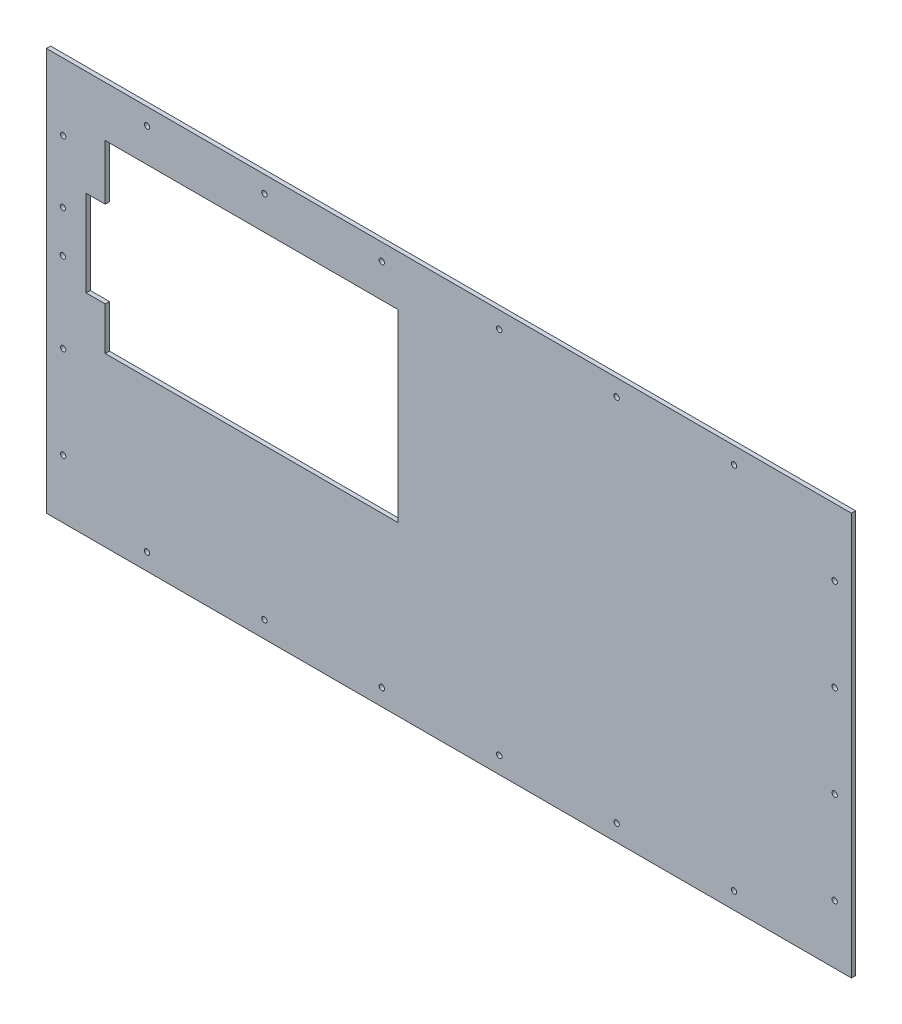
ISO-10303-21;
HEADER;
FILE_DESCRIPTION(('STEP AP214'),'2;1');
FILE_NAME('part.step','',(''),(''),'','','');
FILE_SCHEMA(('AUTOMOTIVE_DESIGN { 1 0 10303 214 1 1 1 1 }'));
ENDSEC;
DATA;
#1=APPLICATION_CONTEXT('core data for automotive mechanical design processes');
#2=APPLICATION_PROTOCOL_DEFINITION('international standard','automotive_design',2000,#1);
#3=PRODUCT_CONTEXT('',#1,'mechanical');
#4=PRODUCT('Part','Part','',(#3));
#5=PRODUCT_RELATED_PRODUCT_CATEGORY('part','',(#4));
#6=PRODUCT_DEFINITION_FORMATION('','',#4);
#7=PRODUCT_DEFINITION_CONTEXT('part definition',#1,'design');
#8=PRODUCT_DEFINITION('design','',#6,#7);
#9=PRODUCT_DEFINITION_SHAPE('','',#8);
#10=(LENGTH_UNIT() NAMED_UNIT(*) SI_UNIT(.MILLI.,.METRE.));
#11=(NAMED_UNIT(*) PLANE_ANGLE_UNIT() SI_UNIT($,.RADIAN.));
#12=(NAMED_UNIT(*) SI_UNIT($,.STERADIAN.) SOLID_ANGLE_UNIT());
#13=UNCERTAINTY_MEASURE_WITH_UNIT(LENGTH_MEASURE(1.E-05),#10,'distance_accuracy_value','');
#14=(GEOMETRIC_REPRESENTATION_CONTEXT(3) GLOBAL_UNCERTAINTY_ASSIGNED_CONTEXT((#13)) GLOBAL_UNIT_ASSIGNED_CONTEXT((#10,
#11,#12)) REPRESENTATION_CONTEXT('',''));
#15=CARTESIAN_POINT('',(0.,0.,0.));
#16=DIRECTION('',(0.,0.,1.));
#17=DIRECTION('',(1.,0.,0.));
#18=AXIS2_PLACEMENT_3D('',#15,#16,#17);
#19=CARTESIAN_POINT('',(-565.03357937027,266.7,0.));
#20=DIRECTION('',(-1.,0.,0.));
#21=DIRECTION('',(0.,0.,1.));
#22=AXIS2_PLACEMENT_3D('',#19,#20,#21);
#23=PLANE('',#22);
#24=DIRECTION('',(0.,-1.,0.));
#25=VECTOR('',#24,1.);
#26=CARTESIAN_POINT('',(-565.03357937027,266.7,3.175));
#27=LINE('',#26,#25);
#28=CARTESIAN_POINT('',(-565.03357937027,266.7,3.175));
#29=VERTEX_POINT('',#28);
#30=CARTESIAN_POINT('',(-565.03357937027,224.893339008683,3.175));
#31=VERTEX_POINT('',#30);
#32=EDGE_CURVE('E173',#29,#31,#27,.T.);
#33=ORIENTED_EDGE('',*,*,#32,.T.);
#34=DIRECTION('',(0.,0.,-1.));
#35=VECTOR('',#34,1.);
#36=CARTESIAN_POINT('',(-565.03357937027,224.893339008683,3.175));
#37=LINE('',#36,#35);
#38=CARTESIAN_POINT('',(-565.03357937027,224.893339008683,0.));
#39=VERTEX_POINT('',#38);
#40=EDGE_CURVE('E154',#31,#39,#37,.T.);
#41=ORIENTED_EDGE('',*,*,#40,.T.);
#42=DIRECTION('',(0.,-1.,0.));
#43=VECTOR('',#42,1.);
#44=CARTESIAN_POINT('',(-565.03357937027,266.7,0.));
#45=LINE('',#44,#43);
#46=CARTESIAN_POINT('',(-565.03357937027,266.7,0.));
#47=VERTEX_POINT('',#46);
#48=EDGE_CURVE('E159',#47,#39,#45,.T.);
#49=ORIENTED_EDGE('',*,*,#48,.F.);
#50=DIRECTION('',(0.,0.,1.));
#51=VECTOR('',#50,1.);
#52=CARTESIAN_POINT('',(-565.03357937027,266.7,0.));
#53=LINE('',#52,#51);
#54=EDGE_CURVE('E185',#47,#29,#53,.T.);
#55=ORIENTED_EDGE('',*,*,#54,.T.);
#56=EDGE_LOOP('',(#33,#41,#49,#55));
#57=FACE_BOUND('',#56,.T.);
#58=ADVANCED_FACE('F36',(#57),#23,.F.);
#59=CARTESIAN_POINT('',(0.,0.,3.175));
#60=DIRECTION('',(0.,0.,1.));
#61=DIRECTION('',(1.,0.,0.));
#62=AXIS2_PLACEMENT_3D('',#59,#60,#61);
#63=PLANE('',#62);
#64=DIRECTION('',(1.,0.,0.));
#65=VECTOR('',#64,1.);
#66=CARTESIAN_POINT('',(-565.03357937027,224.893339008683,3.175));
#67=LINE('',#66,#65);
#68=CARTESIAN_POINT('',(-579.523282634334,224.893339008683,3.175));
#69=VERTEX_POINT('',#68);
#70=EDGE_CURVE('E141',#69,#31,#67,.T.);
#71=ORIENTED_EDGE('',*,*,#70,.T.);
#72=ORIENTED_EDGE('',*,*,#32,.F.);
#73=DIRECTION('',(-1.,0.,0.));
#74=VECTOR('',#73,1.);
#75=CARTESIAN_POINT('',(-565.03357937027,266.7,3.175));
#76=LINE('',#75,#74);
#77=CARTESIAN_POINT('',(-343.33357928627,266.7,3.175));
#78=VERTEX_POINT('',#77);
#79=EDGE_CURVE('E182',#78,#29,#76,.T.);
#80=ORIENTED_EDGE('',*,*,#79,.F.);
#81=DIRECTION('',(0.,1.,0.));
#82=VECTOR('',#81,1.);
#83=CARTESIAN_POINT('',(-343.33357928627,266.7,3.175));
#84=LINE('',#83,#82);
#85=CARTESIAN_POINT('',(-343.33357928627,127.,3.175));
#86=VERTEX_POINT('',#85);
#87=EDGE_CURVE('E179',#86,#78,#84,.T.);
#88=ORIENTED_EDGE('',*,*,#87,.F.);
#89=DIRECTION('',(1.,0.,0.));
#90=VECTOR('',#89,1.);
#91=CARTESIAN_POINT('',(-565.03357937027,127.,3.175));
#92=LINE('',#91,#90);
#93=CARTESIAN_POINT('',(-565.03357937027,127.,3.175));
#94=VERTEX_POINT('',#93);
#95=EDGE_CURVE('E176',#94,#86,#92,.T.);
#96=ORIENTED_EDGE('',*,*,#95,.F.);
#97=CARTESIAN_POINT('',(-565.03357937027,159.519325593124,3.175));
#98=VERTEX_POINT('',#97);
#99=EDGE_CURVE('E58',#98,#94,#27,.T.);
#100=ORIENTED_EDGE('',*,*,#99,.F.);
#101=DIRECTION('',(-1.,0.,0.));
#102=VECTOR('',#101,1.);
#103=CARTESIAN_POINT('',(-565.03357937027,159.519325593124,3.175));
#104=LINE('',#103,#102);
#105=CARTESIAN_POINT('',(-579.523282634334,159.519325593124,3.175));
#106=VERTEX_POINT('',#105);
#107=EDGE_CURVE('E51',#98,#106,#104,.T.);
#108=ORIENTED_EDGE('',*,*,#107,.T.);
#109=DIRECTION('',(0.,1.,0.));
#110=VECTOR('',#109,1.);
#111=CARTESIAN_POINT('',(-579.523282634334,159.519325593124,3.175));
#112=LINE('',#111,#110);
#113=EDGE_CURVE('E136',#106,#69,#112,.T.);
#114=ORIENTED_EDGE('',*,*,#113,.T.);
#115=EDGE_LOOP('',(#71,#72,#80,#88,#96,#100,#108,#114));
#116=FACE_BOUND('',#115,.T.);
#117=CARTESIAN_POINT('',(-597.110646496567,175.018670591768,3.175));
#118=DIRECTION('',(0.,0.,1.));
#119=DIRECTION('',(1.,0.,0.));
#120=AXIS2_PLACEMENT_3D('',#117,#118,#119);
#121=CIRCLE('',#120,2.03200000000001);
#122=CARTESIAN_POINT('',(-595.078646496567,175.018670591768,3.175));
#123=VERTEX_POINT('',#122);
#124=EDGE_CURVE('E197',#123,#123,#121,.T.);
#125=ORIENTED_EDGE('',*,*,#124,.F.);
#126=EDGE_LOOP('',(#125));
#127=FACE_BOUND('',#126,.T.);
#128=CARTESIAN_POINT('',(-597.110646496567,206.768670591768,3.175));
#129=DIRECTION('',(0.,0.,1.));
#130=DIRECTION('',(1.,0.,0.));
#131=AXIS2_PLACEMENT_3D('',#128,#129,#130);
#132=CIRCLE('',#131,2.03200000000001);
#133=CARTESIAN_POINT('',(-595.078646496567,206.768670591768,3.175));
#134=VERTEX_POINT('',#133);
#135=EDGE_CURVE('E187',#134,#134,#132,.T.);
#136=ORIENTED_EDGE('',*,*,#135,.F.);
#137=EDGE_LOOP('',(#136));
#138=FACE_BOUND('',#137,.T.);
#139=CARTESIAN_POINT('',(-596.899999999998,114.3,3.175));
#140=DIRECTION('',(0.,0.,1.));
#141=DIRECTION('',(1.,0.,0.));
#142=AXIS2_PLACEMENT_3D('',#139,#140,#141);
#143=CIRCLE('',#142,2.03200000000001);
#144=CARTESIAN_POINT('',(-594.867999999998,114.3,3.175));
#145=VERTEX_POINT('',#144);
#146=EDGE_CURVE('E243',#145,#145,#143,.F.);
#147=ORIENTED_EDGE('',*,*,#146,.T.);
#148=EDGE_LOOP('',(#147));
#149=FACE_BOUND('',#148,.T.);
#150=CARTESIAN_POINT('',(-596.899999999998,44.45,3.175));
#151=DIRECTION('',(0.,0.,1.));
#152=DIRECTION('',(1.,0.,0.));
#153=AXIS2_PLACEMENT_3D('',#150,#151,#152);
#154=CIRCLE('',#153,2.03200000000001);
#155=CARTESIAN_POINT('',(-594.867999999998,44.45,3.175));
#156=VERTEX_POINT('',#155);
#157=EDGE_CURVE('E240',#156,#156,#154,.F.);
#158=ORIENTED_EDGE('',*,*,#157,.T.);
#159=EDGE_LOOP('',(#158));
#160=FACE_BOUND('',#159,.T.);
#161=CARTESIAN_POINT('',(-596.9,254.,3.175));
#162=DIRECTION('',(0.,0.,1.));
#163=DIRECTION('',(1.,0.,0.));
#164=AXIS2_PLACEMENT_3D('',#161,#162,#163);
#165=CIRCLE('',#164,2.03200000000001);
#166=CARTESIAN_POINT('',(-594.868,254.,3.175));
#167=VERTEX_POINT('',#166);
#168=EDGE_CURVE('E225',#167,#167,#165,.F.);
#169=ORIENTED_EDGE('',*,*,#168,.T.);
#170=EDGE_LOOP('',(#169));
#171=FACE_BOUND('',#170,.T.);
#172=CARTESIAN_POINT('',(-266.7,292.1,3.175));
#173=DIRECTION('',(0.,0.,1.));
#174=DIRECTION('',(-1.,0.,0.));
#175=AXIS2_PLACEMENT_3D('',#172,#173,#174);
#176=CIRCLE('',#175,2.03200000000001);
#177=CARTESIAN_POINT('',(-268.732,292.1,3.175));
#178=VERTEX_POINT('',#177);
#179=EDGE_CURVE('E250',#178,#178,#176,.T.);
#180=ORIENTED_EDGE('',*,*,#179,.F.);
#181=EDGE_LOOP('',(#180));
#182=FACE_BOUND('',#181,.T.);
#183=CARTESIAN_POINT('',(-177.8,292.1,3.175));
#184=DIRECTION('',(0.,0.,1.));
#185=DIRECTION('',(-1.,0.,0.));
#186=AXIS2_PLACEMENT_3D('',#183,#184,#185);
#187=CIRCLE('',#186,2.032);
#188=CARTESIAN_POINT('',(-179.832,292.1,3.175));
#189=VERTEX_POINT('',#188);
#190=EDGE_CURVE('E281',#189,#189,#187,.T.);
#191=ORIENTED_EDGE('',*,*,#190,.F.);
#192=EDGE_LOOP('',(#191));
#193=FACE_BOUND('',#192,.T.);
#194=CARTESIAN_POINT('',(-88.9000000000005,292.1,3.175));
#195=DIRECTION('',(0.,0.,1.));
#196=DIRECTION('',(-1.,0.,0.));
#197=AXIS2_PLACEMENT_3D('',#194,#195,#196);
#198=CIRCLE('',#197,2.032);
#199=CARTESIAN_POINT('',(-90.9320000000005,292.1,3.175));
#200=VERTEX_POINT('',#199);
#201=EDGE_CURVE('E275',#200,#200,#198,.T.);
#202=ORIENTED_EDGE('',*,*,#201,.F.);
#203=EDGE_LOOP('',(#202));
#204=FACE_BOUND('',#203,.T.);
#205=CARTESIAN_POINT('',(-88.9000000000001,12.7,3.175));
#206=DIRECTION('',(0.,0.,1.));
#207=DIRECTION('',(1.,0.,0.));
#208=AXIS2_PLACEMENT_3D('',#205,#206,#207);
#209=CIRCLE('',#208,2.03200000000001);
#210=CARTESIAN_POINT('',(-86.8680000000001,12.7,3.175));
#211=VERTEX_POINT('',#210);
#212=EDGE_CURVE('E269',#211,#211,#209,.T.);
#213=ORIENTED_EDGE('',*,*,#212,.F.);
#214=EDGE_LOOP('',(#213));
#215=FACE_BOUND('',#214,.T.);
#216=CARTESIAN_POINT('',(-177.8,12.7,3.175));
#217=DIRECTION('',(0.,0.,1.));
#218=DIRECTION('',(1.,0.,0.));
#219=AXIS2_PLACEMENT_3D('',#216,#217,#218);
#220=CIRCLE('',#219,2.03200000000001);
#221=CARTESIAN_POINT('',(-175.768,12.7,3.175));
#222=VERTEX_POINT('',#221);
#223=EDGE_CURVE('E268',#222,#222,#220,.T.);
#224=ORIENTED_EDGE('',*,*,#223,.F.);
#225=EDGE_LOOP('',(#224));
#226=FACE_BOUND('',#225,.T.);
#227=CARTESIAN_POINT('',(-266.7,12.7,3.175));
#228=DIRECTION('',(0.,0.,1.));
#229=DIRECTION('',(1.,0.,0.));
#230=AXIS2_PLACEMENT_3D('',#227,#228,#229);
#231=CIRCLE('',#230,2.03200000000001);
#232=CARTESIAN_POINT('',(-264.668,12.7,3.175));
#233=VERTEX_POINT('',#232);
#234=EDGE_CURVE('E305',#233,#233,#231,.T.);
#235=ORIENTED_EDGE('',*,*,#234,.F.);
#236=EDGE_LOOP('',(#235));
#237=FACE_BOUND('',#236,.T.);
#238=CARTESIAN_POINT('',(-355.6,12.7,3.175));
#239=DIRECTION('',(0.,0.,1.));
#240=DIRECTION('',(1.,0.,0.));
#241=AXIS2_PLACEMENT_3D('',#238,#239,#240);
#242=CIRCLE('',#241,2.03200000000001);
#243=CARTESIAN_POINT('',(-353.568,12.7,3.175));
#244=VERTEX_POINT('',#243);
#245=EDGE_CURVE('E299',#244,#244,#242,.T.);
#246=ORIENTED_EDGE('',*,*,#245,.F.);
#247=EDGE_LOOP('',(#246));
#248=FACE_BOUND('',#247,.T.);
#249=CARTESIAN_POINT('',(-444.5,12.7,3.175));
#250=DIRECTION('',(0.,0.,1.));
#251=DIRECTION('',(1.,0.,0.));
#252=AXIS2_PLACEMENT_3D('',#249,#250,#251);
#253=CIRCLE('',#252,2.03200000000001);
#254=CARTESIAN_POINT('',(-442.468,12.7,3.175));
#255=VERTEX_POINT('',#254);
#256=EDGE_CURVE('E293',#255,#255,#253,.T.);
#257=ORIENTED_EDGE('',*,*,#256,.F.);
#258=EDGE_LOOP('',(#257));
#259=FACE_BOUND('',#258,.T.);
#260=CARTESIAN_POINT('',(-355.6,292.1,3.175));
#261=DIRECTION('',(0.,0.,1.));
#262=DIRECTION('',(-1.,0.,0.));
#263=AXIS2_PLACEMENT_3D('',#260,#261,#262);
#264=CIRCLE('',#263,2.03200000000001);
#265=CARTESIAN_POINT('',(-357.632,292.1,3.175));
#266=VERTEX_POINT('',#265);
#267=EDGE_CURVE('E251',#266,#266,#264,.T.);
#268=ORIENTED_EDGE('',*,*,#267,.F.);
#269=EDGE_LOOP('',(#268));
#270=FACE_BOUND('',#269,.T.);
#271=CARTESIAN_POINT('',(-444.5,292.1,3.175));
#272=DIRECTION('',(0.,0.,1.));
#273=DIRECTION('',(-1.,0.,0.));
#274=AXIS2_PLACEMENT_3D('',#271,#272,#273);
#275=CIRCLE('',#274,2.03200000000001);
#276=CARTESIAN_POINT('',(-446.532,292.1,3.175));
#277=VERTEX_POINT('',#276);
#278=EDGE_CURVE('E257',#277,#277,#275,.T.);
#279=ORIENTED_EDGE('',*,*,#278,.F.);
#280=EDGE_LOOP('',(#279));
#281=FACE_BOUND('',#280,.T.);
#282=CARTESIAN_POINT('',(-533.4,292.1,3.175));
#283=DIRECTION('',(0.,0.,1.));
#284=DIRECTION('',(-1.,0.,0.));
#285=AXIS2_PLACEMENT_3D('',#282,#283,#284);
#286=CIRCLE('',#285,2.03200000000001);
#287=CARTESIAN_POINT('',(-535.432,292.1,3.175));
#288=VERTEX_POINT('',#287);
#289=EDGE_CURVE('E246',#288,#288,#286,.T.);
#290=ORIENTED_EDGE('',*,*,#289,.F.);
#291=EDGE_LOOP('',(#290));
#292=FACE_BOUND('',#291,.T.);
#293=CARTESIAN_POINT('',(-533.4,12.7,3.175));
#294=DIRECTION('',(0.,0.,1.));
#295=DIRECTION('',(1.,0.,0.));
#296=AXIS2_PLACEMENT_3D('',#293,#294,#295);
#297=CIRCLE('',#296,2.03200000000001);
#298=CARTESIAN_POINT('',(-531.368,12.7,3.175));
#299=VERTEX_POINT('',#298);
#300=EDGE_CURVE('E292',#299,#299,#297,.T.);
#301=ORIENTED_EDGE('',*,*,#300,.F.);
#302=EDGE_LOOP('',(#301));
#303=FACE_BOUND('',#302,.T.);
#304=DIRECTION('',(0.,1.,0.));
#305=VECTOR('',#304,1.);
#306=CARTESIAN_POINT('',(0.,0.,3.175));
#307=LINE('',#306,#305);
#308=CARTESIAN_POINT('',(0.,0.,3.175));
#309=VERTEX_POINT('',#308);
#310=CARTESIAN_POINT('',(0.,304.8,3.175));
#311=VERTEX_POINT('',#310);
#312=EDGE_CURVE('E319',#309,#311,#307,.T.);
#313=ORIENTED_EDGE('',*,*,#312,.T.);
#314=DIRECTION('',(-1.,0.,0.));
#315=VECTOR('',#314,1.);
#316=CARTESIAN_POINT('',(0.,304.8,3.175));
#317=LINE('',#316,#315);
#318=CARTESIAN_POINT('',(-609.6,304.8,3.175));
#319=VERTEX_POINT('',#318);
#320=EDGE_CURVE('E322',#311,#319,#317,.T.);
#321=ORIENTED_EDGE('',*,*,#320,.T.);
#322=DIRECTION('',(0.,-1.,0.));
#323=VECTOR('',#322,1.);
#324=CARTESIAN_POINT('',(-609.6,0.,3.175));
#325=LINE('',#324,#323);
#326=CARTESIAN_POINT('',(-609.6,0.,3.175));
#327=VERTEX_POINT('',#326);
#328=EDGE_CURVE('E325',#319,#327,#325,.T.);
#329=ORIENTED_EDGE('',*,*,#328,.T.);
#330=DIRECTION('',(1.,0.,0.));
#331=VECTOR('',#330,1.);
#332=CARTESIAN_POINT('',(0.,0.,3.175));
#333=LINE('',#332,#331);
#334=EDGE_CURVE('E327',#327,#309,#333,.T.);
#335=ORIENTED_EDGE('',*,*,#334,.T.);
#336=EDGE_LOOP('',(#313,#321,#329,#335));
#337=FACE_BOUND('',#336,.T.);
#338=CARTESIAN_POINT('',(-12.7000000000024,44.4499999999998,3.175));
#339=DIRECTION('',(0.,0.,1.));
#340=DIRECTION('',(1.,0.,0.));
#341=AXIS2_PLACEMENT_3D('',#338,#339,#340);
#342=CIRCLE('',#341,2.03200000000001);
#343=CARTESIAN_POINT('',(-10.6680000000024,44.4499999999998,3.175));
#344=VERTEX_POINT('',#343);
#345=EDGE_CURVE('E228',#344,#344,#342,.T.);
#346=ORIENTED_EDGE('',*,*,#345,.F.);
#347=EDGE_LOOP('',(#346));
#348=FACE_BOUND('',#347,.T.);
#349=CARTESIAN_POINT('',(-12.7000000000016,114.3,3.175));
#350=DIRECTION('',(0.,0.,1.));
#351=DIRECTION('',(1.,0.,0.));
#352=AXIS2_PLACEMENT_3D('',#349,#350,#351);
#353=CIRCLE('',#352,2.03199999999991);
#354=CARTESIAN_POINT('',(-10.6680000000017,114.3,3.175));
#355=VERTEX_POINT('',#354);
#356=EDGE_CURVE('E231',#355,#355,#353,.T.);
#357=ORIENTED_EDGE('',*,*,#356,.F.);
#358=EDGE_LOOP('',(#357));
#359=FACE_BOUND('',#358,.T.);
#360=CARTESIAN_POINT('',(-12.7000000000008,184.15,3.175));
#361=DIRECTION('',(0.,0.,1.));
#362=DIRECTION('',(1.,0.,0.));
#363=AXIS2_PLACEMENT_3D('',#360,#361,#362);
#364=CIRCLE('',#363,2.03200000000001);
#365=CARTESIAN_POINT('',(-10.6680000000008,184.15,3.175));
#366=VERTEX_POINT('',#365);
#367=EDGE_CURVE('E234',#366,#366,#364,.T.);
#368=ORIENTED_EDGE('',*,*,#367,.F.);
#369=EDGE_LOOP('',(#368));
#370=FACE_BOUND('',#369,.T.);
#371=CARTESIAN_POINT('',(-12.6999999999999,254.,3.175));
#372=DIRECTION('',(0.,0.,1.));
#373=DIRECTION('',(1.,0.,0.));
#374=AXIS2_PLACEMENT_3D('',#371,#372,#373);
#375=CIRCLE('',#374,2.03200000000001);
#376=CARTESIAN_POINT('',(-10.6679999999999,254.,3.175));
#377=VERTEX_POINT('',#376);
#378=EDGE_CURVE('E237',#377,#377,#375,.T.);
#379=ORIENTED_EDGE('',*,*,#378,.F.);
#380=EDGE_LOOP('',(#379));
#381=FACE_BOUND('',#380,.T.);
#382=ADVANCED_FACE('F143',(#116,#127,#138,#149,#160,#171,#182,#193,#204,#215,#226,#237,#248,
#259,#270,#281,#292,#303,#337,#348,#359,#370,#381),#63,.T.);
#383=CARTESIAN_POINT('',(0.,0.,0.));
#384=DIRECTION('',(0.,0.,1.));
#385=DIRECTION('',(1.,0.,0.));
#386=AXIS2_PLACEMENT_3D('',#383,#384,#385);
#387=PLANE('',#386);
#388=ORIENTED_EDGE('',*,*,#48,.T.);
#389=DIRECTION('',(1.,0.,0.));
#390=VECTOR('',#389,1.);
#391=CARTESIAN_POINT('',(-565.03357937027,224.893339008683,0.));
#392=LINE('',#391,#390);
#393=CARTESIAN_POINT('',(-579.523282634334,224.893339008683,0.));
#394=VERTEX_POINT('',#393);
#395=EDGE_CURVE('E146',#394,#39,#392,.T.);
#396=ORIENTED_EDGE('',*,*,#395,.F.);
#397=DIRECTION('',(0.,1.,0.));
#398=VECTOR('',#397,1.);
#399=CARTESIAN_POINT('',(-579.523282634334,159.519325593124,0.));
#400=LINE('',#399,#398);
#401=CARTESIAN_POINT('',(-579.523282634334,159.519325593124,0.));
#402=VERTEX_POINT('',#401);
#403=EDGE_CURVE('E148',#402,#394,#400,.T.);
#404=ORIENTED_EDGE('',*,*,#403,.F.);
#405=DIRECTION('',(-1.,0.,0.));
#406=VECTOR('',#405,1.);
#407=CARTESIAN_POINT('',(-565.03357937027,159.519325593124,0.));
#408=LINE('',#407,#406);
#409=CARTESIAN_POINT('',(-565.03357937027,159.519325593124,0.));
#410=VERTEX_POINT('',#409);
#411=EDGE_CURVE('E128',#410,#402,#408,.T.);
#412=ORIENTED_EDGE('',*,*,#411,.F.);
#413=CARTESIAN_POINT('',(-565.03357937027,127.,0.));
#414=VERTEX_POINT('',#413);
#415=EDGE_CURVE('E163',#410,#414,#45,.T.);
#416=ORIENTED_EDGE('',*,*,#415,.T.);
#417=DIRECTION('',(1.,0.,0.));
#418=VECTOR('',#417,1.);
#419=CARTESIAN_POINT('',(-565.03357937027,127.,0.));
#420=LINE('',#419,#418);
#421=CARTESIAN_POINT('',(-343.33357928627,127.,0.));
#422=VERTEX_POINT('',#421);
#423=EDGE_CURVE('E162',#414,#422,#420,.T.);
#424=ORIENTED_EDGE('',*,*,#423,.T.);
#425=DIRECTION('',(0.,1.,0.));
#426=VECTOR('',#425,1.);
#427=CARTESIAN_POINT('',(-343.33357928627,266.7,0.));
#428=LINE('',#427,#426);
#429=CARTESIAN_POINT('',(-343.33357928627,266.7,0.));
#430=VERTEX_POINT('',#429);
#431=EDGE_CURVE('E166',#422,#430,#428,.T.);
#432=ORIENTED_EDGE('',*,*,#431,.T.);
#433=DIRECTION('',(-1.,0.,0.));
#434=VECTOR('',#433,1.);
#435=CARTESIAN_POINT('',(-565.03357937027,266.7,0.));
#436=LINE('',#435,#434);
#437=EDGE_CURVE('E169',#430,#47,#436,.T.);
#438=ORIENTED_EDGE('',*,*,#437,.T.);
#439=EDGE_LOOP('',(#388,#396,#404,#412,#416,#424,#432,#438));
#440=FACE_BOUND('',#439,.T.);
#441=CARTESIAN_POINT('',(-597.110646496567,175.018670591768,0.));
#442=DIRECTION('',(0.,0.,1.));
#443=DIRECTION('',(1.,0.,0.));
#444=AXIS2_PLACEMENT_3D('',#441,#442,#443);
#445=CIRCLE('',#444,2.03200000000001);
#446=CARTESIAN_POINT('',(-595.078646496567,175.018670591768,0.));
#447=VERTEX_POINT('',#446);
#448=EDGE_CURVE('E193',#447,#447,#445,.T.);
#449=ORIENTED_EDGE('',*,*,#448,.T.);
#450=EDGE_LOOP('',(#449));
#451=FACE_BOUND('',#450,.T.);
#452=CARTESIAN_POINT('',(-597.110646496567,206.768670591768,0.));
#453=DIRECTION('',(0.,0.,1.));
#454=DIRECTION('',(1.,0.,0.));
#455=AXIS2_PLACEMENT_3D('',#452,#453,#454);
#456=CIRCLE('',#455,2.03200000000001);
#457=CARTESIAN_POINT('',(-595.078646496567,206.768670591768,0.));
#458=VERTEX_POINT('',#457);
#459=EDGE_CURVE('E200',#458,#458,#456,.T.);
#460=ORIENTED_EDGE('',*,*,#459,.T.);
#461=EDGE_LOOP('',(#460));
#462=FACE_BOUND('',#461,.T.);
#463=CARTESIAN_POINT('',(-596.899999999998,114.3,0.));
#464=DIRECTION('',(0.,0.,1.));
#465=DIRECTION('',(1.,0.,0.));
#466=AXIS2_PLACEMENT_3D('',#463,#464,#465);
#467=CIRCLE('',#466,2.03200000000001);
#468=CARTESIAN_POINT('',(-594.867999999998,114.3,0.));
#469=VERTEX_POINT('',#468);
#470=EDGE_CURVE('E211',#469,#469,#467,.T.);
#471=ORIENTED_EDGE('',*,*,#470,.T.);
#472=EDGE_LOOP('',(#471));
#473=FACE_BOUND('',#472,.T.);
#474=CARTESIAN_POINT('',(-596.899999999998,44.45,0.));
#475=DIRECTION('',(0.,0.,1.));
#476=DIRECTION('',(1.,0.,0.));
#477=AXIS2_PLACEMENT_3D('',#474,#475,#476);
#478=CIRCLE('',#477,2.03200000000001);
#479=CARTESIAN_POINT('',(-594.867999999998,44.45,0.));
#480=VERTEX_POINT('',#479);
#481=EDGE_CURVE('E215',#480,#480,#478,.T.);
#482=ORIENTED_EDGE('',*,*,#481,.T.);
#483=EDGE_LOOP('',(#482));
#484=FACE_BOUND('',#483,.T.);
#485=CARTESIAN_POINT('',(-12.7000000000008,184.15,0.));
#486=DIRECTION('',(0.,0.,-1.));
#487=DIRECTION('',(-1.,0.,0.));
#488=AXIS2_PLACEMENT_3D('',#485,#486,#487);
#489=CIRCLE('',#488,2.03200000000001);
#490=CARTESIAN_POINT('',(-14.7320000000008,184.15,0.));
#491=VERTEX_POINT('',#490);
#492=EDGE_CURVE('E208',#491,#491,#489,.T.);
#493=ORIENTED_EDGE('',*,*,#492,.F.);
#494=EDGE_LOOP('',(#493));
#495=FACE_BOUND('',#494,.T.);
#496=CARTESIAN_POINT('',(-12.7000000000024,44.4499999999998,0.));
#497=DIRECTION('',(0.,0.,-1.));
#498=DIRECTION('',(-1.,0.,0.));
#499=AXIS2_PLACEMENT_3D('',#496,#497,#498);
#500=CIRCLE('',#499,2.03200000000001);
#501=CARTESIAN_POINT('',(-14.7320000000024,44.4499999999998,0.));
#502=VERTEX_POINT('',#501);
#503=EDGE_CURVE('E196',#502,#502,#500,.T.);
#504=ORIENTED_EDGE('',*,*,#503,.F.);
#505=EDGE_LOOP('',(#504));
#506=FACE_BOUND('',#505,.T.);
#507=CARTESIAN_POINT('',(-596.9,254.,0.));
#508=DIRECTION('',(0.,0.,1.));
#509=DIRECTION('',(1.,0.,0.));
#510=AXIS2_PLACEMENT_3D('',#507,#508,#509);
#511=CIRCLE('',#510,2.03200000000001);
#512=CARTESIAN_POINT('',(-594.868,254.,0.));
#513=VERTEX_POINT('',#512);
#514=EDGE_CURVE('E214',#513,#513,#511,.T.);
#515=ORIENTED_EDGE('',*,*,#514,.T.);
#516=EDGE_LOOP('',(#515));
#517=FACE_BOUND('',#516,.T.);
#518=CARTESIAN_POINT('',(-266.7,292.1,0.));
#519=DIRECTION('',(0.,0.,1.));
#520=DIRECTION('',(-1.,0.,0.));
#521=AXIS2_PLACEMENT_3D('',#518,#519,#520);
#522=CIRCLE('',#521,2.03200000000001);
#523=CARTESIAN_POINT('',(-268.732,292.1,0.));
#524=VERTEX_POINT('',#523);
#525=EDGE_CURVE('E284',#524,#524,#522,.T.);
#526=ORIENTED_EDGE('',*,*,#525,.T.);
#527=EDGE_LOOP('',(#526));
#528=FACE_BOUND('',#527,.T.);
#529=CARTESIAN_POINT('',(-177.8,292.1,0.));
#530=DIRECTION('',(0.,0.,1.));
#531=DIRECTION('',(-1.,0.,0.));
#532=AXIS2_PLACEMENT_3D('',#529,#530,#531);
#533=CIRCLE('',#532,2.032);
#534=CARTESIAN_POINT('',(-179.832,292.1,0.));
#535=VERTEX_POINT('',#534);
#536=EDGE_CURVE('E278',#535,#535,#533,.T.);
#537=ORIENTED_EDGE('',*,*,#536,.T.);
#538=EDGE_LOOP('',(#537));
#539=FACE_BOUND('',#538,.T.);
#540=CARTESIAN_POINT('',(-88.9000000000005,292.1,0.));
#541=DIRECTION('',(0.,0.,1.));
#542=DIRECTION('',(-1.,0.,0.));
#543=AXIS2_PLACEMENT_3D('',#540,#541,#542);
#544=CIRCLE('',#543,2.032);
#545=CARTESIAN_POINT('',(-90.9320000000005,292.1,0.));
#546=VERTEX_POINT('',#545);
#547=EDGE_CURVE('E272',#546,#546,#544,.T.);
#548=ORIENTED_EDGE('',*,*,#547,.T.);
#549=EDGE_LOOP('',(#548));
#550=FACE_BOUND('',#549,.T.);
#551=CARTESIAN_POINT('',(-88.9000000000001,12.7,0.));
#552=DIRECTION('',(0.,0.,1.));
#553=DIRECTION('',(1.,0.,0.));
#554=AXIS2_PLACEMENT_3D('',#551,#552,#553);
#555=CIRCLE('',#554,2.03200000000001);
#556=CARTESIAN_POINT('',(-86.8680000000001,12.7,0.));
#557=VERTEX_POINT('',#556);
#558=EDGE_CURVE('E265',#557,#557,#555,.T.);
#559=ORIENTED_EDGE('',*,*,#558,.T.);
#560=EDGE_LOOP('',(#559));
#561=FACE_BOUND('',#560,.T.);
#562=CARTESIAN_POINT('',(-177.8,12.7,0.));
#563=DIRECTION('',(0.,0.,1.));
#564=DIRECTION('',(1.,0.,0.));
#565=AXIS2_PLACEMENT_3D('',#562,#563,#564);
#566=CIRCLE('',#565,2.03200000000001);
#567=CARTESIAN_POINT('',(-175.768,12.7,0.));
#568=VERTEX_POINT('',#567);
#569=EDGE_CURVE('E308',#568,#568,#566,.T.);
#570=ORIENTED_EDGE('',*,*,#569,.T.);
#571=EDGE_LOOP('',(#570));
#572=FACE_BOUND('',#571,.T.);
#573=CARTESIAN_POINT('',(-266.7,12.7,0.));
#574=DIRECTION('',(0.,0.,1.));
#575=DIRECTION('',(1.,0.,0.));
#576=AXIS2_PLACEMENT_3D('',#573,#574,#575);
#577=CIRCLE('',#576,2.03200000000001);
#578=CARTESIAN_POINT('',(-264.668,12.7,0.));
#579=VERTEX_POINT('',#578);
#580=EDGE_CURVE('E302',#579,#579,#577,.T.);
#581=ORIENTED_EDGE('',*,*,#580,.T.);
#582=EDGE_LOOP('',(#581));
#583=FACE_BOUND('',#582,.T.);
#584=CARTESIAN_POINT('',(-355.6,12.7,0.));
#585=DIRECTION('',(0.,0.,1.));
#586=DIRECTION('',(1.,0.,0.));
#587=AXIS2_PLACEMENT_3D('',#584,#585,#586);
#588=CIRCLE('',#587,2.03200000000001);
#589=CARTESIAN_POINT('',(-353.568,12.7,0.));
#590=VERTEX_POINT('',#589);
#591=EDGE_CURVE('E296',#590,#590,#588,.T.);
#592=ORIENTED_EDGE('',*,*,#591,.T.);
#593=EDGE_LOOP('',(#592));
#594=FACE_BOUND('',#593,.T.);
#595=CARTESIAN_POINT('',(-444.5,12.7,0.));
#596=DIRECTION('',(0.,0.,1.));
#597=DIRECTION('',(1.,0.,0.));
#598=AXIS2_PLACEMENT_3D('',#595,#596,#597);
#599=CIRCLE('',#598,2.03200000000001);
#600=CARTESIAN_POINT('',(-442.468,12.7,0.));
#601=VERTEX_POINT('',#600);
#602=EDGE_CURVE('E289',#601,#601,#599,.T.);
#603=ORIENTED_EDGE('',*,*,#602,.T.);
#604=EDGE_LOOP('',(#603));
#605=FACE_BOUND('',#604,.T.);
#606=CARTESIAN_POINT('',(-355.6,292.1,0.));
#607=DIRECTION('',(0.,0.,1.));
#608=DIRECTION('',(-1.,0.,0.));
#609=AXIS2_PLACEMENT_3D('',#606,#607,#608);
#610=CIRCLE('',#609,2.03200000000001);
#611=CARTESIAN_POINT('',(-357.632,292.1,0.));
#612=VERTEX_POINT('',#611);
#613=EDGE_CURVE('E247',#612,#612,#610,.T.);
#614=ORIENTED_EDGE('',*,*,#613,.T.);
#615=EDGE_LOOP('',(#614));
#616=FACE_BOUND('',#615,.T.);
#617=CARTESIAN_POINT('',(-444.5,292.1,0.));
#618=DIRECTION('',(0.,0.,1.));
#619=DIRECTION('',(-1.,0.,0.));
#620=AXIS2_PLACEMENT_3D('',#617,#618,#619);
#621=CIRCLE('',#620,2.03200000000001);
#622=CARTESIAN_POINT('',(-446.532,292.1,0.));
#623=VERTEX_POINT('',#622);
#624=EDGE_CURVE('E254',#623,#623,#621,.T.);
#625=ORIENTED_EDGE('',*,*,#624,.T.);
#626=EDGE_LOOP('',(#625));
#627=FACE_BOUND('',#626,.T.);
#628=CARTESIAN_POINT('',(-533.4,292.1,0.));
#629=DIRECTION('',(0.,0.,1.));
#630=DIRECTION('',(-1.,0.,0.));
#631=AXIS2_PLACEMENT_3D('',#628,#629,#630);
#632=CIRCLE('',#631,2.03200000000001);
#633=CARTESIAN_POINT('',(-535.432,292.1,0.));
#634=VERTEX_POINT('',#633);
#635=EDGE_CURVE('E260',#634,#634,#632,.T.);
#636=ORIENTED_EDGE('',*,*,#635,.T.);
#637=EDGE_LOOP('',(#636));
#638=FACE_BOUND('',#637,.T.);
#639=CARTESIAN_POINT('',(-533.4,12.7,0.));
#640=DIRECTION('',(0.,0.,1.));
#641=DIRECTION('',(1.,0.,0.));
#642=AXIS2_PLACEMENT_3D('',#639,#640,#641);
#643=CIRCLE('',#642,2.03200000000001);
#644=CARTESIAN_POINT('',(-531.368,12.7,0.));
#645=VERTEX_POINT('',#644);
#646=EDGE_CURVE('E313',#645,#645,#643,.T.);
#647=ORIENTED_EDGE('',*,*,#646,.T.);
#648=EDGE_LOOP('',(#647));
#649=FACE_BOUND('',#648,.T.);
#650=DIRECTION('',(0.,1.,0.));
#651=VECTOR('',#650,1.);
#652=CARTESIAN_POINT('',(0.,0.,0.));
#653=LINE('',#652,#651);
#654=CARTESIAN_POINT('',(0.,0.,0.));
#655=VERTEX_POINT('',#654);
#656=CARTESIAN_POINT('',(0.,304.8,0.));
#657=VERTEX_POINT('',#656);
#658=EDGE_CURVE('E316',#655,#657,#653,.T.);
#659=ORIENTED_EDGE('',*,*,#658,.F.);
#660=DIRECTION('',(1.,0.,0.));
#661=VECTOR('',#660,1.);
#662=CARTESIAN_POINT('',(0.,0.,0.));
#663=LINE('',#662,#661);
#664=CARTESIAN_POINT('',(-609.6,0.,0.));
#665=VERTEX_POINT('',#664);
#666=EDGE_CURVE('E323',#665,#655,#663,.T.);
#667=ORIENTED_EDGE('',*,*,#666,.F.);
#668=DIRECTION('',(0.,-1.,0.));
#669=VECTOR('',#668,1.);
#670=CARTESIAN_POINT('',(-609.6,0.,0.));
#671=LINE('',#670,#669);
#672=CARTESIAN_POINT('',(-609.6,304.8,0.));
#673=VERTEX_POINT('',#672);
#674=EDGE_CURVE('E334',#673,#665,#671,.T.);
#675=ORIENTED_EDGE('',*,*,#674,.F.);
#676=DIRECTION('',(-1.,0.,0.));
#677=VECTOR('',#676,1.);
#678=CARTESIAN_POINT('',(0.,304.8,0.));
#679=LINE('',#678,#677);
#680=EDGE_CURVE('E332',#657,#673,#679,.T.);
#681=ORIENTED_EDGE('',*,*,#680,.F.);
#682=EDGE_LOOP('',(#659,#667,#675,#681));
#683=FACE_BOUND('',#682,.T.);
#684=CARTESIAN_POINT('',(-12.7000000000016,114.3,0.));
#685=DIRECTION('',(0.,0.,-1.));
#686=DIRECTION('',(-1.,0.,0.));
#687=AXIS2_PLACEMENT_3D('',#684,#685,#686);
#688=CIRCLE('',#687,2.03199999999991);
#689=CARTESIAN_POINT('',(-14.7320000000015,114.3,0.));
#690=VERTEX_POINT('',#689);
#691=EDGE_CURVE('E205',#690,#690,#688,.T.);
#692=ORIENTED_EDGE('',*,*,#691,.F.);
#693=EDGE_LOOP('',(#692));
#694=FACE_BOUND('',#693,.T.);
#695=CARTESIAN_POINT('',(-12.6999999999999,254.,0.));
#696=DIRECTION('',(0.,0.,-1.));
#697=DIRECTION('',(-1.,0.,0.));
#698=AXIS2_PLACEMENT_3D('',#695,#696,#697);
#699=CIRCLE('',#698,2.03200000000001);
#700=CARTESIAN_POINT('',(-14.7319999999999,254.,0.));
#701=VERTEX_POINT('',#700);
#702=EDGE_CURVE('E218',#701,#701,#699,.T.);
#703=ORIENTED_EDGE('',*,*,#702,.F.);
#704=EDGE_LOOP('',(#703));
#705=FACE_BOUND('',#704,.T.);
#706=ADVANCED_FACE('F352',(#440,#451,#462,#473,#484,#495,#506,#517,#528,#539,#550,#561,#572,
#583,#594,#605,#616,#627,#638,#649,#683,#694,#705),#387,.F.);
#707=CARTESIAN_POINT('',(0.,0.,3.175));
#708=DIRECTION('',(-1.,0.,0.));
#709=DIRECTION('',(0.,0.,1.));
#710=AXIS2_PLACEMENT_3D('',#707,#708,#709);
#711=PLANE('',#710);
#712=ORIENTED_EDGE('',*,*,#658,.T.);
#713=DIRECTION('',(0.,0.,-1.));
#714=VECTOR('',#713,1.);
#715=CARTESIAN_POINT('',(0.,304.8,3.175));
#716=LINE('',#715,#714);
#717=EDGE_CURVE('E11',#311,#657,#716,.T.);
#718=ORIENTED_EDGE('',*,*,#717,.F.);
#719=ORIENTED_EDGE('',*,*,#312,.F.);
#720=DIRECTION('',(0.,0.,-1.));
#721=VECTOR('',#720,1.);
#722=CARTESIAN_POINT('',(0.,0.,3.175));
#723=LINE('',#722,#721);
#724=EDGE_CURVE('E329',#309,#655,#723,.T.);
#725=ORIENTED_EDGE('',*,*,#724,.T.);
#726=EDGE_LOOP('',(#712,#718,#719,#725));
#727=FACE_BOUND('',#726,.T.);
#728=ADVANCED_FACE('F38',(#727),#711,.F.);
#729=CARTESIAN_POINT('',(0.,304.8,3.175));
#730=DIRECTION('',(0.,-1.,0.));
#731=DIRECTION('',(1.,0.,0.));
#732=AXIS2_PLACEMENT_3D('',#729,#730,#731);
#733=PLANE('',#732);
#734=ORIENTED_EDGE('',*,*,#680,.T.);
#735=DIRECTION('',(0.,0.,-1.));
#736=VECTOR('',#735,1.);
#737=CARTESIAN_POINT('',(-609.6,304.8,3.175));
#738=LINE('',#737,#736);
#739=EDGE_CURVE('E44',#319,#673,#738,.T.);
#740=ORIENTED_EDGE('',*,*,#739,.F.);
#741=ORIENTED_EDGE('',*,*,#320,.F.);
#742=ORIENTED_EDGE('',*,*,#717,.T.);
#743=EDGE_LOOP('',(#734,#740,#741,#742));
#744=FACE_BOUND('',#743,.T.);
#745=ADVANCED_FACE('F363',(#744),#733,.F.);
#746=CARTESIAN_POINT('',(-609.6,0.,3.175));
#747=DIRECTION('',(1.,0.,0.));
#748=DIRECTION('',(0.,0.,-1.));
#749=AXIS2_PLACEMENT_3D('',#746,#747,#748);
#750=PLANE('',#749);
#751=ORIENTED_EDGE('',*,*,#674,.T.);
#752=DIRECTION('',(0.,0.,-1.));
#753=VECTOR('',#752,1.);
#754=CARTESIAN_POINT('',(-609.6,0.,3.175));
#755=LINE('',#754,#753);
#756=EDGE_CURVE('E339',#327,#665,#755,.T.);
#757=ORIENTED_EDGE('',*,*,#756,.F.);
#758=ORIENTED_EDGE('',*,*,#328,.F.);
#759=ORIENTED_EDGE('',*,*,#739,.T.);
#760=EDGE_LOOP('',(#751,#757,#758,#759));
#761=FACE_BOUND('',#760,.T.);
#762=ADVANCED_FACE('F346',(#761),#750,.F.);
#763=CARTESIAN_POINT('',(0.,0.,3.175));
#764=DIRECTION('',(0.,1.,0.));
#765=DIRECTION('',(0.,0.,1.));
#766=AXIS2_PLACEMENT_3D('',#763,#764,#765);
#767=PLANE('',#766);
#768=ORIENTED_EDGE('',*,*,#666,.T.);
#769=ORIENTED_EDGE('',*,*,#724,.F.);
#770=ORIENTED_EDGE('',*,*,#334,.F.);
#771=ORIENTED_EDGE('',*,*,#756,.T.);
#772=EDGE_LOOP('',(#768,#769,#770,#771));
#773=FACE_BOUND('',#772,.T.);
#774=ADVANCED_FACE('F356',(#773),#767,.F.);
#775=CARTESIAN_POINT('',(-533.4,12.7,0.));
#776=DIRECTION('',(0.,0.,1.));
#777=DIRECTION('',(1.,0.,0.));
#778=AXIS2_PLACEMENT_3D('',#775,#776,#777);
#779=CYLINDRICAL_SURFACE('',#778,2.03200000000001);
#780=ORIENTED_EDGE('',*,*,#646,.F.);
#781=EDGE_LOOP('',(#780));
#782=FACE_BOUND('',#781,.T.);
#783=ORIENTED_EDGE('',*,*,#300,.T.);
#784=EDGE_LOOP('',(#783));
#785=FACE_BOUND('',#784,.T.);
#786=ADVANCED_FACE('F644',(#782,#785),#779,.F.);
#787=CARTESIAN_POINT('',(-533.4,292.1,0.));
#788=DIRECTION('',(0.,0.,1.));
#789=DIRECTION('',(1.,0.,0.));
#790=AXIS2_PLACEMENT_3D('',#787,#788,#789);
#791=CYLINDRICAL_SURFACE('',#790,2.03200000000001);
#792=ORIENTED_EDGE('',*,*,#635,.F.);
#793=EDGE_LOOP('',(#792));
#794=FACE_BOUND('',#793,.T.);
#795=ORIENTED_EDGE('',*,*,#289,.T.);
#796=EDGE_LOOP('',(#795));
#797=FACE_BOUND('',#796,.T.);
#798=ADVANCED_FACE('F635',(#794,#797),#791,.F.);
#799=CARTESIAN_POINT('',(-444.5,292.1,0.));
#800=DIRECTION('',(0.,0.,1.));
#801=DIRECTION('',(1.,0.,0.));
#802=AXIS2_PLACEMENT_3D('',#799,#800,#801);
#803=CYLINDRICAL_SURFACE('',#802,2.03200000000001);
#804=ORIENTED_EDGE('',*,*,#624,.F.);
#805=EDGE_LOOP('',(#804));
#806=FACE_BOUND('',#805,.T.);
#807=ORIENTED_EDGE('',*,*,#278,.T.);
#808=EDGE_LOOP('',(#807));
#809=FACE_BOUND('',#808,.T.);
#810=ADVANCED_FACE('F626',(#806,#809),#803,.F.);
#811=CARTESIAN_POINT('',(-355.6,292.1,0.));
#812=DIRECTION('',(0.,0.,1.));
#813=DIRECTION('',(1.,0.,0.));
#814=AXIS2_PLACEMENT_3D('',#811,#812,#813);
#815=CYLINDRICAL_SURFACE('',#814,2.03200000000001);
#816=ORIENTED_EDGE('',*,*,#613,.F.);
#817=EDGE_LOOP('',(#816));
#818=FACE_BOUND('',#817,.T.);
#819=ORIENTED_EDGE('',*,*,#267,.T.);
#820=EDGE_LOOP('',(#819));
#821=FACE_BOUND('',#820,.T.);
#822=ADVANCED_FACE('F617',(#818,#821),#815,.F.);
#823=CARTESIAN_POINT('',(-444.5,12.7,0.));
#824=DIRECTION('',(0.,0.,1.));
#825=DIRECTION('',(1.,0.,0.));
#826=AXIS2_PLACEMENT_3D('',#823,#824,#825);
#827=CYLINDRICAL_SURFACE('',#826,2.03200000000001);
#828=ORIENTED_EDGE('',*,*,#602,.F.);
#829=EDGE_LOOP('',(#828));
#830=FACE_BOUND('',#829,.T.);
#831=ORIENTED_EDGE('',*,*,#256,.T.);
#832=EDGE_LOOP('',(#831));
#833=FACE_BOUND('',#832,.T.);
#834=ADVANCED_FACE('F608',(#830,#833),#827,.F.);
#835=CARTESIAN_POINT('',(-355.6,12.7,0.));
#836=DIRECTION('',(0.,0.,1.));
#837=DIRECTION('',(1.,0.,0.));
#838=AXIS2_PLACEMENT_3D('',#835,#836,#837);
#839=CYLINDRICAL_SURFACE('',#838,2.03200000000001);
#840=ORIENTED_EDGE('',*,*,#591,.F.);
#841=EDGE_LOOP('',(#840));
#842=FACE_BOUND('',#841,.T.);
#843=ORIENTED_EDGE('',*,*,#245,.T.);
#844=EDGE_LOOP('',(#843));
#845=FACE_BOUND('',#844,.T.);
#846=ADVANCED_FACE('F599',(#842,#845),#839,.F.);
#847=CARTESIAN_POINT('',(-266.7,12.7,0.));
#848=DIRECTION('',(0.,0.,1.));
#849=DIRECTION('',(1.,0.,0.));
#850=AXIS2_PLACEMENT_3D('',#847,#848,#849);
#851=CYLINDRICAL_SURFACE('',#850,2.03200000000001);
#852=ORIENTED_EDGE('',*,*,#580,.F.);
#853=EDGE_LOOP('',(#852));
#854=FACE_BOUND('',#853,.T.);
#855=ORIENTED_EDGE('',*,*,#234,.T.);
#856=EDGE_LOOP('',(#855));
#857=FACE_BOUND('',#856,.T.);
#858=ADVANCED_FACE('F590',(#854,#857),#851,.F.);
#859=CARTESIAN_POINT('',(-177.8,12.7,0.));
#860=DIRECTION('',(0.,0.,1.));
#861=DIRECTION('',(1.,0.,0.));
#862=AXIS2_PLACEMENT_3D('',#859,#860,#861);
#863=CYLINDRICAL_SURFACE('',#862,2.03200000000001);
#864=ORIENTED_EDGE('',*,*,#569,.F.);
#865=EDGE_LOOP('',(#864));
#866=FACE_BOUND('',#865,.T.);
#867=ORIENTED_EDGE('',*,*,#223,.T.);
#868=EDGE_LOOP('',(#867));
#869=FACE_BOUND('',#868,.T.);
#870=ADVANCED_FACE('F581',(#866,#869),#863,.F.);
#871=CARTESIAN_POINT('',(-88.9000000000001,12.7,0.));
#872=DIRECTION('',(0.,0.,1.));
#873=DIRECTION('',(1.,0.,0.));
#874=AXIS2_PLACEMENT_3D('',#871,#872,#873);
#875=CYLINDRICAL_SURFACE('',#874,2.03200000000001);
#876=ORIENTED_EDGE('',*,*,#558,.F.);
#877=EDGE_LOOP('',(#876));
#878=FACE_BOUND('',#877,.T.);
#879=ORIENTED_EDGE('',*,*,#212,.T.);
#880=EDGE_LOOP('',(#879));
#881=FACE_BOUND('',#880,.T.);
#882=ADVANCED_FACE('F572',(#878,#881),#875,.F.);
#883=CARTESIAN_POINT('',(-88.9000000000005,292.1,0.));
#884=DIRECTION('',(0.,0.,1.));
#885=DIRECTION('',(1.,0.,0.));
#886=AXIS2_PLACEMENT_3D('',#883,#884,#885);
#887=CYLINDRICAL_SURFACE('',#886,2.032);
#888=ORIENTED_EDGE('',*,*,#547,.F.);
#889=EDGE_LOOP('',(#888));
#890=FACE_BOUND('',#889,.T.);
#891=ORIENTED_EDGE('',*,*,#201,.T.);
#892=EDGE_LOOP('',(#891));
#893=FACE_BOUND('',#892,.T.);
#894=ADVANCED_FACE('F563',(#890,#893),#887,.F.);
#895=CARTESIAN_POINT('',(-177.8,292.1,0.));
#896=DIRECTION('',(0.,0.,1.));
#897=DIRECTION('',(1.,0.,0.));
#898=AXIS2_PLACEMENT_3D('',#895,#896,#897);
#899=CYLINDRICAL_SURFACE('',#898,2.032);
#900=ORIENTED_EDGE('',*,*,#536,.F.);
#901=EDGE_LOOP('',(#900));
#902=FACE_BOUND('',#901,.T.);
#903=ORIENTED_EDGE('',*,*,#190,.T.);
#904=EDGE_LOOP('',(#903));
#905=FACE_BOUND('',#904,.T.);
#906=ADVANCED_FACE('F554',(#902,#905),#899,.F.);
#907=CARTESIAN_POINT('',(-266.7,292.1,0.));
#908=DIRECTION('',(0.,0.,1.));
#909=DIRECTION('',(1.,0.,0.));
#910=AXIS2_PLACEMENT_3D('',#907,#908,#909);
#911=CYLINDRICAL_SURFACE('',#910,2.03200000000001);
#912=ORIENTED_EDGE('',*,*,#525,.F.);
#913=EDGE_LOOP('',(#912));
#914=FACE_BOUND('',#913,.T.);
#915=ORIENTED_EDGE('',*,*,#179,.T.);
#916=EDGE_LOOP('',(#915));
#917=FACE_BOUND('',#916,.T.);
#918=ADVANCED_FACE('F535',(#914,#917),#911,.F.);
#919=CARTESIAN_POINT('',(-596.9,254.,13.175));
#920=DIRECTION('',(0.,0.,-1.));
#921=DIRECTION('',(-1.,0.,0.));
#922=AXIS2_PLACEMENT_3D('',#919,#920,#921);
#923=CYLINDRICAL_SURFACE('',#922,2.03200000000001);
#924=ORIENTED_EDGE('',*,*,#168,.F.);
#925=EDGE_LOOP('',(#924));
#926=FACE_BOUND('',#925,.T.);
#927=ORIENTED_EDGE('',*,*,#514,.F.);
#928=EDGE_LOOP('',(#927));
#929=FACE_BOUND('',#928,.T.);
#930=ADVANCED_FACE('F526',(#926,#929),#923,.F.);
#931=CARTESIAN_POINT('',(-12.7000000000024,44.4499999999998,13.175));
#932=DIRECTION('',(0.,0.,-1.));
#933=DIRECTION('',(-1.,0.,0.));
#934=AXIS2_PLACEMENT_3D('',#931,#932,#933);
#935=CYLINDRICAL_SURFACE('',#934,2.03200000000001);
#936=ORIENTED_EDGE('',*,*,#345,.T.);
#937=EDGE_LOOP('',(#936));
#938=FACE_BOUND('',#937,.T.);
#939=ORIENTED_EDGE('',*,*,#503,.T.);
#940=EDGE_LOOP('',(#939));
#941=FACE_BOUND('',#940,.T.);
#942=ADVANCED_FACE('F517',(#938,#941),#935,.F.);
#943=CARTESIAN_POINT('',(-12.7000000000016,114.3,13.175));
#944=DIRECTION('',(0.,0.,-1.));
#945=DIRECTION('',(-1.,0.,0.));
#946=AXIS2_PLACEMENT_3D('',#943,#944,#945);
#947=CYLINDRICAL_SURFACE('',#946,2.03199999999991);
#948=ORIENTED_EDGE('',*,*,#356,.T.);
#949=EDGE_LOOP('',(#948));
#950=FACE_BOUND('',#949,.T.);
#951=ORIENTED_EDGE('',*,*,#691,.T.);
#952=EDGE_LOOP('',(#951));
#953=FACE_BOUND('',#952,.T.);
#954=ADVANCED_FACE('F508',(#950,#953),#947,.F.);
#955=CARTESIAN_POINT('',(-12.7000000000008,184.15,13.175));
#956=DIRECTION('',(0.,0.,-1.));
#957=DIRECTION('',(-1.,0.,0.));
#958=AXIS2_PLACEMENT_3D('',#955,#956,#957);
#959=CYLINDRICAL_SURFACE('',#958,2.03200000000001);
#960=ORIENTED_EDGE('',*,*,#367,.T.);
#961=EDGE_LOOP('',(#960));
#962=FACE_BOUND('',#961,.T.);
#963=ORIENTED_EDGE('',*,*,#492,.T.);
#964=EDGE_LOOP('',(#963));
#965=FACE_BOUND('',#964,.T.);
#966=ADVANCED_FACE('F499',(#962,#965),#959,.F.);
#967=CARTESIAN_POINT('',(-12.6999999999999,254.,13.175));
#968=DIRECTION('',(0.,0.,-1.));
#969=DIRECTION('',(-1.,0.,0.));
#970=AXIS2_PLACEMENT_3D('',#967,#968,#969);
#971=CYLINDRICAL_SURFACE('',#970,2.03200000000001);
#972=ORIENTED_EDGE('',*,*,#378,.T.);
#973=EDGE_LOOP('',(#972));
#974=FACE_BOUND('',#973,.T.);
#975=ORIENTED_EDGE('',*,*,#702,.T.);
#976=EDGE_LOOP('',(#975));
#977=FACE_BOUND('',#976,.T.);
#978=ADVANCED_FACE('F490',(#974,#977),#971,.F.);
#979=CARTESIAN_POINT('',(-596.899999999998,44.45,13.175));
#980=DIRECTION('',(0.,0.,-1.));
#981=DIRECTION('',(-1.,0.,0.));
#982=AXIS2_PLACEMENT_3D('',#979,#980,#981);
#983=CYLINDRICAL_SURFACE('',#982,2.03200000000001);
#984=ORIENTED_EDGE('',*,*,#157,.F.);
#985=EDGE_LOOP('',(#984));
#986=FACE_BOUND('',#985,.T.);
#987=ORIENTED_EDGE('',*,*,#481,.F.);
#988=EDGE_LOOP('',(#987));
#989=FACE_BOUND('',#988,.T.);
#990=ADVANCED_FACE('F481',(#986,#989),#983,.F.);
#991=CARTESIAN_POINT('',(-596.899999999998,114.3,13.175));
#992=DIRECTION('',(0.,0.,-1.));
#993=DIRECTION('',(-1.,0.,0.));
#994=AXIS2_PLACEMENT_3D('',#991,#992,#993);
#995=CYLINDRICAL_SURFACE('',#994,2.03200000000001);
#996=ORIENTED_EDGE('',*,*,#146,.F.);
#997=EDGE_LOOP('',(#996));
#998=FACE_BOUND('',#997,.T.);
#999=ORIENTED_EDGE('',*,*,#470,.F.);
#1000=EDGE_LOOP('',(#999));
#1001=FACE_BOUND('',#1000,.T.);
#1002=ADVANCED_FACE('F472',(#998,#1001),#995,.F.);
#1003=CARTESIAN_POINT('',(-597.110646496567,206.768670591768,0.));
#1004=DIRECTION('',(0.,0.,1.));
#1005=DIRECTION('',(1.,0.,0.));
#1006=AXIS2_PLACEMENT_3D('',#1003,#1004,#1005);
#1007=CYLINDRICAL_SURFACE('',#1006,2.03200000000001);
#1008=ORIENTED_EDGE('',*,*,#459,.F.);
#1009=EDGE_LOOP('',(#1008));
#1010=FACE_BOUND('',#1009,.T.);
#1011=ORIENTED_EDGE('',*,*,#135,.T.);
#1012=EDGE_LOOP('',(#1011));
#1013=FACE_BOUND('',#1012,.T.);
#1014=ADVANCED_FACE('F390',(#1010,#1013),#1007,.F.);
#1015=CARTESIAN_POINT('',(-597.110646496567,175.018670591768,0.));
#1016=DIRECTION('',(0.,0.,1.));
#1017=DIRECTION('',(1.,0.,0.));
#1018=AXIS2_PLACEMENT_3D('',#1015,#1016,#1017);
#1019=CYLINDRICAL_SURFACE('',#1018,2.03200000000001);
#1020=ORIENTED_EDGE('',*,*,#448,.F.);
#1021=EDGE_LOOP('',(#1020));
#1022=FACE_BOUND('',#1021,.T.);
#1023=ORIENTED_EDGE('',*,*,#124,.T.);
#1024=EDGE_LOOP('',(#1023));
#1025=FACE_BOUND('',#1024,.T.);
#1026=ADVANCED_FACE('F382',(#1022,#1025),#1019,.F.);
#1027=ORIENTED_EDGE('',*,*,#415,.F.);
#1028=DIRECTION('',(0.,0.,-1.));
#1029=VECTOR('',#1028,1.);
#1030=CARTESIAN_POINT('',(-565.03357937027,159.519325593124,3.175));
#1031=LINE('',#1030,#1029);
#1032=EDGE_CURVE('E133',#98,#410,#1031,.T.);
#1033=ORIENTED_EDGE('',*,*,#1032,.F.);
#1034=ORIENTED_EDGE('',*,*,#99,.T.);
#1035=DIRECTION('',(0.,0.,1.));
#1036=VECTOR('',#1035,1.);
#1037=CARTESIAN_POINT('',(-565.03357937027,127.,0.));
#1038=LINE('',#1037,#1036);
#1039=EDGE_CURVE('E172',#414,#94,#1038,.T.);
#1040=ORIENTED_EDGE('',*,*,#1039,.F.);
#1041=EDGE_LOOP('',(#1027,#1033,#1034,#1040));
#1042=FACE_BOUND('',#1041,.T.);
#1043=ADVANCED_FACE('F373',(#1042),#23,.F.);
#1044=CARTESIAN_POINT('',(-565.03357937027,266.7,0.));
#1045=DIRECTION('',(0.,1.,0.));
#1046=DIRECTION('',(0.,0.,1.));
#1047=AXIS2_PLACEMENT_3D('',#1044,#1045,#1046);
#1048=PLANE('',#1047);
#1049=ORIENTED_EDGE('',*,*,#79,.T.);
#1050=ORIENTED_EDGE('',*,*,#54,.F.);
#1051=ORIENTED_EDGE('',*,*,#437,.F.);
#1052=DIRECTION('',(0.,0.,1.));
#1053=VECTOR('',#1052,1.);
#1054=CARTESIAN_POINT('',(-343.33357928627,266.7,0.));
#1055=LINE('',#1054,#1053);
#1056=EDGE_CURVE('E188',#430,#78,#1055,.T.);
#1057=ORIENTED_EDGE('',*,*,#1056,.T.);
#1058=EDGE_LOOP('',(#1049,#1050,#1051,#1057));
#1059=FACE_BOUND('',#1058,.T.);
#1060=ADVANCED_FACE('F381',(#1059),#1048,.F.);
#1061=CARTESIAN_POINT('',(-343.33357928627,266.7,0.));
#1062=DIRECTION('',(1.,0.,0.));
#1063=DIRECTION('',(0.,0.,-1.));
#1064=AXIS2_PLACEMENT_3D('',#1061,#1062,#1063);
#1065=PLANE('',#1064);
#1066=ORIENTED_EDGE('',*,*,#87,.T.);
#1067=ORIENTED_EDGE('',*,*,#1056,.F.);
#1068=ORIENTED_EDGE('',*,*,#431,.F.);
#1069=DIRECTION('',(0.,0.,1.));
#1070=VECTOR('',#1069,1.);
#1071=CARTESIAN_POINT('',(-343.33357928627,127.,0.));
#1072=LINE('',#1071,#1070);
#1073=EDGE_CURVE('E190',#422,#86,#1072,.T.);
#1074=ORIENTED_EDGE('',*,*,#1073,.T.);
#1075=EDGE_LOOP('',(#1066,#1067,#1068,#1074));
#1076=FACE_BOUND('',#1075,.T.);
#1077=ADVANCED_FACE('F387',(#1076),#1065,.F.);
#1078=CARTESIAN_POINT('',(-565.03357937027,127.,0.));
#1079=DIRECTION('',(0.,-1.,0.));
#1080=DIRECTION('',(0.,0.,-1.));
#1081=AXIS2_PLACEMENT_3D('',#1078,#1079,#1080);
#1082=PLANE('',#1081);
#1083=ORIENTED_EDGE('',*,*,#95,.T.);
#1084=ORIENTED_EDGE('',*,*,#1073,.F.);
#1085=ORIENTED_EDGE('',*,*,#423,.F.);
#1086=ORIENTED_EDGE('',*,*,#1039,.T.);
#1087=EDGE_LOOP('',(#1083,#1084,#1085,#1086));
#1088=FACE_BOUND('',#1087,.T.);
#1089=ADVANCED_FACE('F407',(#1088),#1082,.F.);
#1090=CARTESIAN_POINT('',(-565.03357937027,224.893339008683,3.175));
#1091=DIRECTION('',(0.,1.,0.));
#1092=DIRECTION('',(0.,0.,1.));
#1093=AXIS2_PLACEMENT_3D('',#1090,#1091,#1092);
#1094=PLANE('',#1093);
#1095=ORIENTED_EDGE('',*,*,#395,.T.);
#1096=ORIENTED_EDGE('',*,*,#40,.F.);
#1097=ORIENTED_EDGE('',*,*,#70,.F.);
#1098=DIRECTION('',(0.,0.,-1.));
#1099=VECTOR('',#1098,1.);
#1100=CARTESIAN_POINT('',(-579.523282634334,224.893339008683,3.175));
#1101=LINE('',#1100,#1099);
#1102=EDGE_CURVE('E132',#69,#394,#1101,.T.);
#1103=ORIENTED_EDGE('',*,*,#1102,.T.);
#1104=EDGE_LOOP('',(#1095,#1096,#1097,#1103));
#1105=FACE_BOUND('',#1104,.T.);
#1106=ADVANCED_FACE('F399',(#1105),#1094,.F.);
#1107=CARTESIAN_POINT('',(-579.523282634334,159.519325593124,3.175));
#1108=DIRECTION('',(-1.,0.,0.));
#1109=DIRECTION('',(0.,0.,1.));
#1110=AXIS2_PLACEMENT_3D('',#1107,#1108,#1109);
#1111=PLANE('',#1110);
#1112=ORIENTED_EDGE('',*,*,#403,.T.);
#1113=ORIENTED_EDGE('',*,*,#1102,.F.);
#1114=ORIENTED_EDGE('',*,*,#113,.F.);
#1115=DIRECTION('',(0.,0.,-1.));
#1116=VECTOR('',#1115,1.);
#1117=CARTESIAN_POINT('',(-579.523282634334,159.519325593124,3.175));
#1118=LINE('',#1117,#1116);
#1119=EDGE_CURVE('E124',#106,#402,#1118,.T.);
#1120=ORIENTED_EDGE('',*,*,#1119,.T.);
#1121=EDGE_LOOP('',(#1112,#1113,#1114,#1120));
#1122=FACE_BOUND('',#1121,.T.);
#1123=ADVANCED_FACE('F137',(#1122),#1111,.F.);
#1124=CARTESIAN_POINT('',(-565.03357937027,159.519325593124,3.175));
#1125=DIRECTION('',(0.,-1.,0.));
#1126=DIRECTION('',(0.,0.,-1.));
#1127=AXIS2_PLACEMENT_3D('',#1124,#1125,#1126);
#1128=PLANE('',#1127);
#1129=ORIENTED_EDGE('',*,*,#411,.T.);
#1130=ORIENTED_EDGE('',*,*,#1119,.F.);
#1131=ORIENTED_EDGE('',*,*,#107,.F.);
#1132=ORIENTED_EDGE('',*,*,#1032,.T.);
#1133=EDGE_LOOP('',(#1129,#1130,#1131,#1132));
#1134=FACE_BOUND('',#1133,.T.);
#1135=ADVANCED_FACE('F126',(#1134),#1128,.F.);
#1136=CLOSED_SHELL('',(#58,#382,#706,#728,#745,#762,#774,#786,#798,#810,#822,#834,#846,#858,
#870,#882,#894,#906,#918,#930,#942,#954,#966,#978,#990,#1002,#1014,#1026,#1043,#1060,#1077,
#1089,#1106,#1123,#1135));
#1137=MANIFOLD_SOLID_BREP('B2',#1136);
#1138=ADVANCED_BREP_SHAPE_REPRESENTATION('',(#18,#1137),#14);
#1139=SHAPE_DEFINITION_REPRESENTATION(#9,#1138);
ENDSEC;
END-ISO-10303-21;
